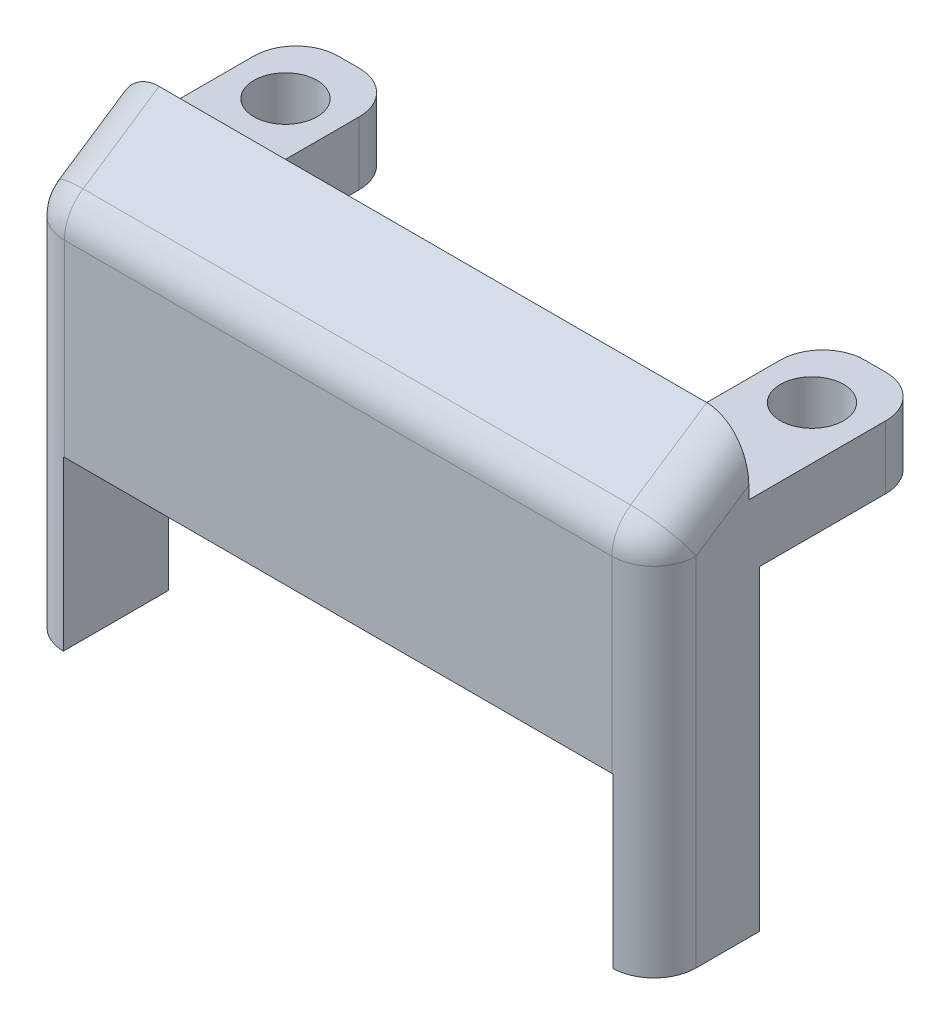
ISO-10303-21;
HEADER;
FILE_DESCRIPTION(('STEP AP214'),'2;1');
FILE_NAME('part.step','',(''),(''),'','','');
FILE_SCHEMA(('AUTOMOTIVE_DESIGN { 1 0 10303 214 1 1 1 1 }'));
ENDSEC;
DATA;
#1=APPLICATION_CONTEXT('core data for automotive mechanical design processes');
#2=APPLICATION_PROTOCOL_DEFINITION('international standard','automotive_design',2000,#1);
#3=PRODUCT_CONTEXT('',#1,'mechanical');
#4=PRODUCT('Part','Part','',(#3));
#5=PRODUCT_RELATED_PRODUCT_CATEGORY('part','',(#4));
#6=PRODUCT_DEFINITION_FORMATION('','',#4);
#7=PRODUCT_DEFINITION_CONTEXT('part definition',#1,'design');
#8=PRODUCT_DEFINITION('design','',#6,#7);
#9=PRODUCT_DEFINITION_SHAPE('','',#8);
#10=(LENGTH_UNIT() NAMED_UNIT(*) SI_UNIT(.MILLI.,.METRE.));
#11=(NAMED_UNIT(*) PLANE_ANGLE_UNIT() SI_UNIT($,.RADIAN.));
#12=(NAMED_UNIT(*) SI_UNIT($,.STERADIAN.) SOLID_ANGLE_UNIT());
#13=UNCERTAINTY_MEASURE_WITH_UNIT(LENGTH_MEASURE(1.E-05),#10,'distance_accuracy_value','');
#14=(GEOMETRIC_REPRESENTATION_CONTEXT(3) GLOBAL_UNCERTAINTY_ASSIGNED_CONTEXT((#13)) GLOBAL_UNIT_ASSIGNED_CONTEXT((#10,
#11,#12)) REPRESENTATION_CONTEXT('',''));
#15=CARTESIAN_POINT('',(0.,0.,0.));
#16=DIRECTION('',(0.,0.,1.));
#17=DIRECTION('',(1.,0.,0.));
#18=AXIS2_PLACEMENT_3D('',#15,#16,#17);
#19=CARTESIAN_POINT('',(13.05,10.,0.));
#20=DIRECTION('',(0.,1.,0.));
#21=DIRECTION('',(0.,0.,1.));
#22=AXIS2_PLACEMENT_3D('',#19,#20,#21);
#23=PLANE('',#22);
#24=CARTESIAN_POINT('',(-12.5,10.,-10.));
#25=DIRECTION('',(0.,1.,0.));
#26=DIRECTION('',(0.,0.,1.));
#27=AXIS2_PLACEMENT_3D('',#24,#25,#26);
#28=CIRCLE('',#27,1.5);
#29=CARTESIAN_POINT('',(-12.5,10.,-8.5));
#30=VERTEX_POINT('',#29);
#31=EDGE_CURVE('E292',#30,#30,#28,.T.);
#32=ORIENTED_EDGE('',*,*,#31,.F.);
#33=EDGE_LOOP('',(#32));
#34=FACE_BOUND('',#33,.T.);
#35=CARTESIAN_POINT('',(12.5,10.,-10.));
#36=DIRECTION('',(0.,1.,0.));
#37=DIRECTION('',(0.,0.,-1.));
#38=AXIS2_PLACEMENT_3D('',#35,#36,#37);
#39=CIRCLE('',#38,1.5);
#40=CARTESIAN_POINT('',(12.5,10.,-11.5));
#41=VERTEX_POINT('',#40);
#42=EDGE_CURVE('E288',#41,#41,#39,.T.);
#43=ORIENTED_EDGE('',*,*,#42,.F.);
#44=EDGE_LOOP('',(#43));
#45=FACE_BOUND('',#44,.T.);
#46=DIRECTION('',(-1.,0.,0.));
#47=VECTOR('',#46,1.);
#48=CARTESIAN_POINT('',(-15.,10.,-13.));
#49=LINE('',#48,#47);
#50=CARTESIAN_POINT('',(-12.,10.,-13.));
#51=VERTEX_POINT('',#50);
#52=CARTESIAN_POINT('',(-13.,10.,-13.));
#53=VERTEX_POINT('',#52);
#54=EDGE_CURVE('E308',#51,#53,#49,.T.);
#55=ORIENTED_EDGE('',*,*,#54,.T.);
#56=CARTESIAN_POINT('',(-13.,10.,-11.));
#57=DIRECTION('',(0.,1.,0.));
#58=DIRECTION('',(0.,0.,1.));
#59=AXIS2_PLACEMENT_3D('',#56,#57,#58);
#60=CIRCLE('',#59,2.);
#61=CARTESIAN_POINT('',(-15.,10.,-11.));
#62=VERTEX_POINT('',#61);
#63=EDGE_CURVE('E236',#53,#62,#60,.T.);
#64=ORIENTED_EDGE('',*,*,#63,.T.);
#65=DIRECTION('',(0.,0.,1.));
#66=VECTOR('',#65,1.);
#67=CARTESIAN_POINT('',(-15.,10.,0.));
#68=LINE('',#67,#66);
#69=CARTESIAN_POINT('',(-15.,10.,-4.5));
#70=VERTEX_POINT('',#69);
#71=EDGE_CURVE('E230',#62,#70,#68,.T.);
#72=ORIENTED_EDGE('',*,*,#71,.T.);
#73=DIRECTION('',(1.,0.,0.));
#74=VECTOR('',#73,1.);
#75=CARTESIAN_POINT('',(-20.408326913196,10.,-4.5));
#76=LINE('',#75,#74);
#77=CARTESIAN_POINT('',(15.,10.,-4.5));
#78=VERTEX_POINT('',#77);
#79=EDGE_CURVE('E235',#70,#78,#76,.T.);
#80=ORIENTED_EDGE('',*,*,#79,.T.);
#81=DIRECTION('',(0.,0.,1.));
#82=VECTOR('',#81,1.);
#83=CARTESIAN_POINT('',(15.,10.,0.));
#84=LINE('',#83,#82);
#85=CARTESIAN_POINT('',(15.,10.,-11.));
#86=VERTEX_POINT('',#85);
#87=EDGE_CURVE('E319',#86,#78,#84,.T.);
#88=ORIENTED_EDGE('',*,*,#87,.F.);
#89=CARTESIAN_POINT('',(13.,10.,-11.));
#90=DIRECTION('',(0.,1.,0.));
#91=DIRECTION('',(0.,0.,1.));
#92=AXIS2_PLACEMENT_3D('',#89,#90,#91);
#93=CIRCLE('',#92,2.);
#94=CARTESIAN_POINT('',(13.,10.,-13.));
#95=VERTEX_POINT('',#94);
#96=EDGE_CURVE('E435',#86,#95,#93,.T.);
#97=ORIENTED_EDGE('',*,*,#96,.T.);
#98=DIRECTION('',(-1.,0.,0.));
#99=VECTOR('',#98,1.);
#100=CARTESIAN_POINT('',(15.,10.,-13.));
#101=LINE('',#100,#99);
#102=CARTESIAN_POINT('',(12.,10.,-13.));
#103=VERTEX_POINT('',#102);
#104=EDGE_CURVE('E272',#95,#103,#101,.T.);
#105=ORIENTED_EDGE('',*,*,#104,.T.);
#106=CARTESIAN_POINT('',(12.,10.,-11.));
#107=DIRECTION('',(0.,1.,0.));
#108=DIRECTION('',(0.,0.,1.));
#109=AXIS2_PLACEMENT_3D('',#106,#107,#108);
#110=CIRCLE('',#109,2.);
#111=CARTESIAN_POINT('',(10.,10.,-11.));
#112=VERTEX_POINT('',#111);
#113=EDGE_CURVE('E438',#103,#112,#110,.T.);
#114=ORIENTED_EDGE('',*,*,#113,.T.);
#115=DIRECTION('',(0.,0.,1.));
#116=VECTOR('',#115,1.);
#117=CARTESIAN_POINT('',(10.,10.,-5.));
#118=LINE('',#117,#116);
#119=CARTESIAN_POINT('',(10.,10.,-7.));
#120=VERTEX_POINT('',#119);
#121=EDGE_CURVE('E268',#112,#120,#118,.T.);
#122=ORIENTED_EDGE('',*,*,#121,.T.);
#123=CARTESIAN_POINT('',(8.,10.,-7.));
#124=DIRECTION('',(0.,1.,0.));
#125=DIRECTION('',(0.,0.,1.));
#126=AXIS2_PLACEMENT_3D('',#123,#124,#125);
#127=CIRCLE('',#126,2.);
#128=CARTESIAN_POINT('',(8.,10.,-5.));
#129=VERTEX_POINT('',#128);
#130=EDGE_CURVE('E494',#120,#129,#127,.F.);
#131=ORIENTED_EDGE('',*,*,#130,.T.);
#132=DIRECTION('',(-1.,0.,0.));
#133=VECTOR('',#132,1.);
#134=CARTESIAN_POINT('',(13.05,10.,-5.));
#135=LINE('',#134,#133);
#136=CARTESIAN_POINT('',(-8.,10.,-5.));
#137=VERTEX_POINT('',#136);
#138=EDGE_CURVE('E384',#129,#137,#135,.T.);
#139=ORIENTED_EDGE('',*,*,#138,.T.);
#140=CARTESIAN_POINT('',(-8.,10.,-7.));
#141=DIRECTION('',(0.,1.,0.));
#142=DIRECTION('',(0.,0.,1.));
#143=AXIS2_PLACEMENT_3D('',#140,#141,#142);
#144=CIRCLE('',#143,2.);
#145=CARTESIAN_POINT('',(-10.,10.,-7.));
#146=VERTEX_POINT('',#145);
#147=EDGE_CURVE('E487',#137,#146,#144,.F.);
#148=ORIENTED_EDGE('',*,*,#147,.T.);
#149=DIRECTION('',(0.,0.,-1.));
#150=VECTOR('',#149,1.);
#151=CARTESIAN_POINT('',(-10.,10.,-5.));
#152=LINE('',#151,#150);
#153=CARTESIAN_POINT('',(-10.,10.,-11.));
#154=VERTEX_POINT('',#153);
#155=EDGE_CURVE('E300',#146,#154,#152,.T.);
#156=ORIENTED_EDGE('',*,*,#155,.T.);
#157=CARTESIAN_POINT('',(-12.,10.,-11.));
#158=DIRECTION('',(0.,1.,0.));
#159=DIRECTION('',(0.,0.,1.));
#160=AXIS2_PLACEMENT_3D('',#157,#158,#159);
#161=CIRCLE('',#160,2.);
#162=EDGE_CURVE('E441',#154,#51,#161,.T.);
#163=ORIENTED_EDGE('',*,*,#162,.T.);
#164=EDGE_LOOP('',(#55,#64,#72,#80,#88,#97,#105,#114,#122,#131,#139,#148,#156,#163));
#165=FACE_BOUND('',#164,.T.);
#166=ADVANCED_FACE('F49',(#34,#45,#165),#23,.T.);
#167=CARTESIAN_POINT('',(13.05,4.,0.));
#168=DIRECTION('',(0.,1.,0.));
#169=DIRECTION('',(0.,0.,1.));
#170=AXIS2_PLACEMENT_3D('',#167,#168,#169);
#171=PLANE('',#170);
#172=DIRECTION('',(0.,0.,-1.));
#173=VECTOR('',#172,1.);
#174=CARTESIAN_POINT('',(-13.05,4.,0.));
#175=LINE('',#174,#173);
#176=CARTESIAN_POINT('',(-13.05,4.,-3.));
#177=VERTEX_POINT('',#176);
#178=CARTESIAN_POINT('',(-13.05,4.,-5.));
#179=VERTEX_POINT('',#178);
#180=EDGE_CURVE('E359',#177,#179,#175,.T.);
#181=ORIENTED_EDGE('',*,*,#180,.T.);
#182=DIRECTION('',(-1.,0.,0.));
#183=VECTOR('',#182,1.);
#184=CARTESIAN_POINT('',(13.05,4.,-5.));
#185=LINE('',#184,#183);
#186=CARTESIAN_POINT('',(13.05,4.,-5.));
#187=VERTEX_POINT('',#186);
#188=EDGE_CURVE('E388',#187,#179,#185,.T.);
#189=ORIENTED_EDGE('',*,*,#188,.F.);
#190=DIRECTION('',(0.,0.,-1.));
#191=VECTOR('',#190,1.);
#192=CARTESIAN_POINT('',(13.05,4.,0.));
#193=LINE('',#192,#191);
#194=CARTESIAN_POINT('',(13.05,4.,-3.));
#195=VERTEX_POINT('',#194);
#196=EDGE_CURVE('E363',#195,#187,#193,.T.);
#197=ORIENTED_EDGE('',*,*,#196,.F.);
#198=DIRECTION('',(-1.,0.,0.));
#199=VECTOR('',#198,1.);
#200=CARTESIAN_POINT('',(13.05,4.,-3.));
#201=LINE('',#200,#199);
#202=EDGE_CURVE('E371',#195,#177,#201,.T.);
#203=ORIENTED_EDGE('',*,*,#202,.T.);
#204=EDGE_LOOP('',(#181,#189,#197,#203));
#205=FACE_BOUND('',#204,.T.);
#206=ADVANCED_FACE('F579',(#205),#171,.F.);
#207=CARTESIAN_POINT('',(13.05,0.,-5.));
#208=DIRECTION('',(0.,0.,1.));
#209=DIRECTION('',(1.,0.,0.));
#210=AXIS2_PLACEMENT_3D('',#207,#208,#209);
#211=PLANE('',#210);
#212=DIRECTION('',(1.,0.,0.));
#213=VECTOR('',#212,1.);
#214=CARTESIAN_POINT('',(-15.,7.,-5.));
#215=LINE('',#214,#213);
#216=CARTESIAN_POINT('',(-15.,7.,-5.));
#217=VERTEX_POINT('',#216);
#218=CARTESIAN_POINT('',(-8.,7.,-5.));
#219=VERTEX_POINT('',#218);
#220=EDGE_CURVE('E307',#217,#219,#215,.T.);
#221=ORIENTED_EDGE('',*,*,#220,.T.);
#222=DIRECTION('',(0.,1.,0.));
#223=VECTOR('',#222,1.);
#224=CARTESIAN_POINT('',(-8.,0.,-5.));
#225=LINE('',#224,#223);
#226=EDGE_CURVE('E463',#219,#137,#225,.T.);
#227=ORIENTED_EDGE('',*,*,#226,.T.);
#228=ORIENTED_EDGE('',*,*,#138,.F.);
#229=DIRECTION('',(0.,1.,0.));
#230=VECTOR('',#229,1.);
#231=CARTESIAN_POINT('',(8.,0.,-5.));
#232=LINE('',#231,#230);
#233=CARTESIAN_POINT('',(8.,7.,-5.));
#234=VERTEX_POINT('',#233);
#235=EDGE_CURVE('E459',#129,#234,#232,.F.);
#236=ORIENTED_EDGE('',*,*,#235,.T.);
#237=DIRECTION('',(1.,0.,0.));
#238=VECTOR('',#237,1.);
#239=CARTESIAN_POINT('',(15.,7.,-5.));
#240=LINE('',#239,#238);
#241=CARTESIAN_POINT('',(15.,7.,-5.));
#242=VERTEX_POINT('',#241);
#243=EDGE_CURVE('E259',#234,#242,#240,.T.);
#244=ORIENTED_EDGE('',*,*,#243,.T.);
#245=DIRECTION('',(0.,1.,0.));
#246=VECTOR('',#245,1.);
#247=CARTESIAN_POINT('',(15.,-8.,-5.));
#248=LINE('',#247,#246);
#249=CARTESIAN_POINT('',(15.,-8.,-5.));
#250=VERTEX_POINT('',#249);
#251=EDGE_CURVE('E335',#250,#242,#248,.T.);
#252=ORIENTED_EDGE('',*,*,#251,.F.);
#253=DIRECTION('',(1.,0.,0.));
#254=VECTOR('',#253,1.);
#255=CARTESIAN_POINT('',(0.,-8.,-5.));
#256=LINE('',#255,#254);
#257=CARTESIAN_POINT('',(13.05,-8.,-5.));
#258=VERTEX_POINT('',#257);
#259=EDGE_CURVE('E329',#258,#250,#256,.T.);
#260=ORIENTED_EDGE('',*,*,#259,.F.);
#261=DIRECTION('',(0.,1.,0.));
#262=VECTOR('',#261,1.);
#263=CARTESIAN_POINT('',(13.05,-8.,-5.));
#264=LINE('',#263,#262);
#265=EDGE_CURVE('E241',#258,#187,#264,.T.);
#266=ORIENTED_EDGE('',*,*,#265,.T.);
#267=ORIENTED_EDGE('',*,*,#188,.T.);
#268=DIRECTION('',(0.,1.,0.));
#269=VECTOR('',#268,1.);
#270=CARTESIAN_POINT('',(-13.05,-8.,-5.));
#271=LINE('',#270,#269);
#272=CARTESIAN_POINT('',(-13.05,-8.,-5.));
#273=VERTEX_POINT('',#272);
#274=EDGE_CURVE('E353',#273,#179,#271,.T.);
#275=ORIENTED_EDGE('',*,*,#274,.F.);
#276=DIRECTION('',(1.,0.,0.));
#277=VECTOR('',#276,1.);
#278=CARTESIAN_POINT('',(0.,-8.,-5.));
#279=LINE('',#278,#277);
#280=CARTESIAN_POINT('',(-15.,-8.,-5.));
#281=VERTEX_POINT('',#280);
#282=EDGE_CURVE('E351',#281,#273,#279,.T.);
#283=ORIENTED_EDGE('',*,*,#282,.F.);
#284=DIRECTION('',(0.,1.,0.));
#285=VECTOR('',#284,1.);
#286=CARTESIAN_POINT('',(-15.,-8.,-5.));
#287=LINE('',#286,#285);
#288=EDGE_CURVE('E355',#281,#217,#287,.T.);
#289=ORIENTED_EDGE('',*,*,#288,.T.);
#290=EDGE_LOOP('',(#221,#227,#228,#236,#244,#252,#260,#266,#267,#275,#283,#289));
#291=FACE_BOUND('',#290,.T.);
#292=ADVANCED_FACE('F587',(#291),#211,.F.);
#293=CARTESIAN_POINT('',(13.05,0.,0.));
#294=DIRECTION('',(0.,0.,1.));
#295=DIRECTION('',(1.,0.,0.));
#296=AXIS2_PLACEMENT_3D('',#293,#294,#295);
#297=PLANE('',#296);
#298=DIRECTION('',(0.,1.,0.));
#299=VECTOR('',#298,1.);
#300=CARTESIAN_POINT('',(13.,10.,0.));
#301=LINE('',#300,#299);
#302=CARTESIAN_POINT('',(13.,0.,0.));
#303=VERTEX_POINT('',#302);
#304=CARTESIAN_POINT('',(13.,8.92963248302401,0.));
#305=VERTEX_POINT('',#304);
#306=EDGE_CURVE('E394',#303,#305,#301,.T.);
#307=ORIENTED_EDGE('',*,*,#306,.T.);
#308=DIRECTION('',(-1.,0.,0.));
#309=VECTOR('',#308,1.);
#310=CARTESIAN_POINT('',(13.05,8.92963248302401,0.));
#311=LINE('',#310,#309);
#312=CARTESIAN_POINT('',(-13.,8.92963248302401,0.));
#313=VERTEX_POINT('',#312);
#314=EDGE_CURVE('E11',#305,#313,#311,.T.);
#315=ORIENTED_EDGE('',*,*,#314,.T.);
#316=DIRECTION('',(0.,1.,0.));
#317=VECTOR('',#316,1.);
#318=CARTESIAN_POINT('',(-13.,0.,0.));
#319=LINE('',#318,#317);
#320=CARTESIAN_POINT('',(-13.,0.,0.));
#321=VERTEX_POINT('',#320);
#322=EDGE_CURVE('E391',#313,#321,#319,.F.);
#323=ORIENTED_EDGE('',*,*,#322,.T.);
#324=DIRECTION('',(-1.,0.,0.));
#325=VECTOR('',#324,1.);
#326=CARTESIAN_POINT('',(13.05,0.,0.));
#327=LINE('',#326,#325);
#328=EDGE_CURVE('E380',#303,#321,#327,.T.);
#329=ORIENTED_EDGE('',*,*,#328,.F.);
#330=EDGE_LOOP('',(#307,#315,#323,#329));
#331=FACE_BOUND('',#330,.T.);
#332=ADVANCED_FACE('F563',(#331),#297,.T.);
#333=CARTESIAN_POINT('',(13.05,0.,0.));
#334=DIRECTION('',(0.,-0.6,-0.8));
#335=DIRECTION('',(0.,0.8,-0.6));
#336=AXIS2_PLACEMENT_3D('',#333,#334,#335);
#337=PLANE('',#336);
#338=DIRECTION('',(0.,-0.8,0.6));
#339=VECTOR('',#338,1.);
#340=CARTESIAN_POINT('',(13.05,0.,0.));
#341=LINE('',#340,#339);
#342=CARTESIAN_POINT('',(13.05,0.000833463582372244,-0.000625097686779725));
#343=VERTEX_POINT('',#342);
#344=EDGE_CURVE('E366',#195,#343,#341,.T.);
#345=ORIENTED_EDGE('',*,*,#344,.T.);
#346=CARTESIAN_POINT('',(13.,2.66666666666667,-2.));
#347=DIRECTION('',(0.,-0.6,-0.8));
#348=DIRECTION('',(0.,-0.8,0.6));
#349=AXIS2_PLACEMENT_3D('',#346,#347,#348);
#350=ELLIPSE('',#349,3.33333333333333,2.);
#351=EDGE_CURVE('E413',#343,#303,#350,.T.);
#352=ORIENTED_EDGE('',*,*,#351,.T.);
#353=ORIENTED_EDGE('',*,*,#328,.T.);
#354=CARTESIAN_POINT('',(-13.,2.66666666666667,-2.));
#355=DIRECTION('',(0.,-0.6,-0.8));
#356=DIRECTION('',(0.,0.8,-0.6));
#357=AXIS2_PLACEMENT_3D('',#354,#355,#356);
#358=ELLIPSE('',#357,3.33333333333333,2.);
#359=CARTESIAN_POINT('',(-13.05,0.000833463582372244,-0.000625097686779725));
#360=VERTEX_POINT('',#359);
#361=EDGE_CURVE('E410',#321,#360,#358,.T.);
#362=ORIENTED_EDGE('',*,*,#361,.T.);
#363=DIRECTION('',(0.,-0.8,0.6));
#364=VECTOR('',#363,1.);
#365=CARTESIAN_POINT('',(-13.05,0.,0.));
#366=LINE('',#365,#364);
#367=EDGE_CURVE('E367',#177,#360,#366,.T.);
#368=ORIENTED_EDGE('',*,*,#367,.F.);
#369=ORIENTED_EDGE('',*,*,#202,.F.);
#370=EDGE_LOOP('',(#345,#352,#353,#362,#368,#369));
#371=FACE_BOUND('',#370,.T.);
#372=ADVANCED_FACE('F844',(#371),#337,.T.);
#373=CARTESIAN_POINT('',(-15.,-8.,0.));
#374=DIRECTION('',(-1.,0.,0.));
#375=DIRECTION('',(0.,0.,1.));
#376=AXIS2_PLACEMENT_3D('',#373,#374,#375);
#377=PLANE('',#376);
#378=DIRECTION('',(0.,1.,0.));
#379=VECTOR('',#378,1.);
#380=CARTESIAN_POINT('',(-15.,-8.,-2.));
#381=LINE('',#380,#379);
#382=CARTESIAN_POINT('',(-15.,-8.,-2.));
#383=VERTEX_POINT('',#382);
#384=CARTESIAN_POINT('',(-15.,8.929632483024,-2.));
#385=VERTEX_POINT('',#384);
#386=EDGE_CURVE('E419',#383,#385,#381,.T.);
#387=ORIENTED_EDGE('',*,*,#386,.T.);
#388=DIRECTION('',(0.,-0.554700196225229,0.832050294337844));
#389=VECTOR('',#388,1.);
#390=CARTESIAN_POINT('',(-15.,2.79743787286277,7.19829191524185));
#391=LINE('',#390,#389);
#392=CARTESIAN_POINT('',(-15.,10.5962991496907,-4.5));
#393=VERTEX_POINT('',#392);
#394=EDGE_CURVE('E247',#385,#393,#391,.F.);
#395=ORIENTED_EDGE('',*,*,#394,.T.);
#396=DIRECTION('',(0.,1.,0.));
#397=VECTOR('',#396,1.);
#398=CARTESIAN_POINT('',(-15.,13.,-4.5));
#399=LINE('',#398,#397);
#400=EDGE_CURVE('E244',#70,#393,#399,.T.);
#401=ORIENTED_EDGE('',*,*,#400,.F.);
#402=ORIENTED_EDGE('',*,*,#71,.F.);
#403=DIRECTION('',(0.,1.,0.));
#404=VECTOR('',#403,1.);
#405=CARTESIAN_POINT('',(-15.,-8.,-11.));
#406=LINE('',#405,#404);
#407=CARTESIAN_POINT('',(-15.,7.,-11.));
#408=VERTEX_POINT('',#407);
#409=EDGE_CURVE('E416',#62,#408,#406,.F.);
#410=ORIENTED_EDGE('',*,*,#409,.T.);
#411=DIRECTION('',(0.,0.,1.));
#412=VECTOR('',#411,1.);
#413=CARTESIAN_POINT('',(-15.,7.,-5.));
#414=LINE('',#413,#412);
#415=EDGE_CURVE('E304',#408,#217,#414,.T.);
#416=ORIENTED_EDGE('',*,*,#415,.T.);
#417=ORIENTED_EDGE('',*,*,#288,.F.);
#418=DIRECTION('',(0.,0.,1.));
#419=VECTOR('',#418,1.);
#420=CARTESIAN_POINT('',(-15.,-8.,0.));
#421=LINE('',#420,#419);
#422=EDGE_CURVE('E240',#281,#383,#421,.T.);
#423=ORIENTED_EDGE('',*,*,#422,.T.);
#424=EDGE_LOOP('',(#387,#395,#401,#402,#410,#416,#417,#423));
#425=FACE_BOUND('',#424,.T.);
#426=ADVANCED_FACE('F245',(#425),#377,.T.);
#427=CARTESIAN_POINT('',(-13.05,-8.,0.));
#428=DIRECTION('',(-1.,0.,0.));
#429=DIRECTION('',(0.,0.,1.));
#430=AXIS2_PLACEMENT_3D('',#427,#428,#429);
#431=PLANE('',#430);
#432=ORIENTED_EDGE('',*,*,#367,.T.);
#433=DIRECTION('',(0.,1.,0.));
#434=VECTOR('',#433,1.);
#435=CARTESIAN_POINT('',(-13.05,0.00083346358237214,-0.000625097686779864));
#436=LINE('',#435,#434);
#437=CARTESIAN_POINT('',(-13.05,-8.,-0.000625097686779864));
#438=VERTEX_POINT('',#437);
#439=EDGE_CURVE('E422',#360,#438,#436,.F.);
#440=ORIENTED_EDGE('',*,*,#439,.T.);
#441=DIRECTION('',(0.,0.,1.));
#442=VECTOR('',#441,1.);
#443=CARTESIAN_POINT('',(-13.05,-8.,0.));
#444=LINE('',#443,#442);
#445=EDGE_CURVE('E347',#273,#438,#444,.T.);
#446=ORIENTED_EDGE('',*,*,#445,.F.);
#447=ORIENTED_EDGE('',*,*,#274,.T.);
#448=ORIENTED_EDGE('',*,*,#180,.F.);
#449=EDGE_LOOP('',(#432,#440,#446,#447,#448));
#450=FACE_BOUND('',#449,.T.);
#451=ADVANCED_FACE('F826',(#450),#431,.F.);
#452=CARTESIAN_POINT('',(0.,-8.,0.));
#453=DIRECTION('',(0.,1.,0.));
#454=DIRECTION('',(0.,0.,1.));
#455=AXIS2_PLACEMENT_3D('',#452,#453,#454);
#456=PLANE('',#455);
#457=ORIENTED_EDGE('',*,*,#445,.T.);
#458=CARTESIAN_POINT('',(-13.,-8.,-2.));
#459=DIRECTION('',(0.,1.,0.));
#460=DIRECTION('',(0.,0.,1.));
#461=AXIS2_PLACEMENT_3D('',#458,#459,#460);
#462=CIRCLE('',#461,2.);
#463=EDGE_CURVE('E425',#438,#383,#462,.F.);
#464=ORIENTED_EDGE('',*,*,#463,.T.);
#465=ORIENTED_EDGE('',*,*,#422,.F.);
#466=ORIENTED_EDGE('',*,*,#282,.T.);
#467=EDGE_LOOP('',(#457,#464,#465,#466));
#468=FACE_BOUND('',#467,.T.);
#469=ADVANCED_FACE('F817',(#468),#456,.F.);
#470=CARTESIAN_POINT('',(13.05,-8.,0.));
#471=DIRECTION('',(1.,0.,0.));
#472=DIRECTION('',(0.,0.,-1.));
#473=AXIS2_PLACEMENT_3D('',#470,#471,#472);
#474=PLANE('',#473);
#475=DIRECTION('',(0.,0.,-1.));
#476=VECTOR('',#475,1.);
#477=CARTESIAN_POINT('',(13.05,-8.,0.));
#478=LINE('',#477,#476);
#479=CARTESIAN_POINT('',(13.05,-8.,-0.000625097686779864));
#480=VERTEX_POINT('',#479);
#481=EDGE_CURVE('E332',#480,#258,#478,.T.);
#482=ORIENTED_EDGE('',*,*,#481,.F.);
#483=DIRECTION('',(0.,-1.,0.));
#484=VECTOR('',#483,1.);
#485=CARTESIAN_POINT('',(13.05,-8.,-0.000625097686779864));
#486=LINE('',#485,#484);
#487=EDGE_CURVE('E407',#480,#343,#486,.F.);
#488=ORIENTED_EDGE('',*,*,#487,.T.);
#489=ORIENTED_EDGE('',*,*,#344,.F.);
#490=ORIENTED_EDGE('',*,*,#196,.T.);
#491=ORIENTED_EDGE('',*,*,#265,.F.);
#492=EDGE_LOOP('',(#482,#488,#489,#490,#491));
#493=FACE_BOUND('',#492,.T.);
#494=ADVANCED_FACE('F808',(#493),#474,.F.);
#495=CARTESIAN_POINT('',(15.,-8.,0.));
#496=DIRECTION('',(-1.,0.,0.));
#497=DIRECTION('',(0.,0.,1.));
#498=AXIS2_PLACEMENT_3D('',#495,#496,#497);
#499=PLANE('',#498);
#500=DIRECTION('',(0.,1.,0.));
#501=VECTOR('',#500,1.);
#502=CARTESIAN_POINT('',(15.,13.,-4.5));
#503=LINE('',#502,#501);
#504=CARTESIAN_POINT('',(15.,10.5962991496907,-4.5));
#505=VERTEX_POINT('',#504);
#506=EDGE_CURVE('E252',#78,#505,#503,.T.);
#507=ORIENTED_EDGE('',*,*,#506,.T.);
#508=DIRECTION('',(0.,-0.554700196225229,0.832050294337844));
#509=VECTOR('',#508,1.);
#510=CARTESIAN_POINT('',(15.,9.66923274465765,-3.10940039245046));
#511=LINE('',#510,#509);
#512=CARTESIAN_POINT('',(15.,8.929632483024,-2.));
#513=VERTEX_POINT('',#512);
#514=EDGE_CURVE('E500',#505,#513,#511,.T.);
#515=ORIENTED_EDGE('',*,*,#514,.T.);
#516=DIRECTION('',(0.,1.,0.));
#517=VECTOR('',#516,1.);
#518=CARTESIAN_POINT('',(15.,-8.,-2.));
#519=LINE('',#518,#517);
#520=CARTESIAN_POINT('',(15.,-8.,-2.));
#521=VERTEX_POINT('',#520);
#522=EDGE_CURVE('E401',#513,#521,#519,.F.);
#523=ORIENTED_EDGE('',*,*,#522,.T.);
#524=DIRECTION('',(0.,0.,1.));
#525=VECTOR('',#524,1.);
#526=CARTESIAN_POINT('',(15.,-8.,0.));
#527=LINE('',#526,#525);
#528=EDGE_CURVE('E325',#250,#521,#527,.T.);
#529=ORIENTED_EDGE('',*,*,#528,.F.);
#530=ORIENTED_EDGE('',*,*,#251,.T.);
#531=DIRECTION('',(0.,0.,-1.));
#532=VECTOR('',#531,1.);
#533=CARTESIAN_POINT('',(15.,7.,-5.));
#534=LINE('',#533,#532);
#535=CARTESIAN_POINT('',(15.,7.,-11.));
#536=VERTEX_POINT('',#535);
#537=EDGE_CURVE('E273',#242,#536,#534,.T.);
#538=ORIENTED_EDGE('',*,*,#537,.T.);
#539=DIRECTION('',(0.,1.,0.));
#540=VECTOR('',#539,1.);
#541=CARTESIAN_POINT('',(15.,10.,-11.));
#542=LINE('',#541,#540);
#543=EDGE_CURVE('E397',#536,#86,#542,.T.);
#544=ORIENTED_EDGE('',*,*,#543,.T.);
#545=ORIENTED_EDGE('',*,*,#87,.T.);
#546=EDGE_LOOP('',(#507,#515,#523,#529,#530,#538,#544,#545));
#547=FACE_BOUND('',#546,.T.);
#548=ADVANCED_FACE('F546',(#547),#499,.F.);
#549=CARTESIAN_POINT('',(0.,-8.,0.));
#550=DIRECTION('',(0.,1.,0.));
#551=DIRECTION('',(0.,0.,1.));
#552=AXIS2_PLACEMENT_3D('',#549,#550,#551);
#553=PLANE('',#552);
#554=ORIENTED_EDGE('',*,*,#528,.T.);
#555=CARTESIAN_POINT('',(13.,-8.,-2.));
#556=DIRECTION('',(0.,1.,0.));
#557=DIRECTION('',(0.,0.,1.));
#558=AXIS2_PLACEMENT_3D('',#555,#556,#557);
#559=CIRCLE('',#558,2.);
#560=EDGE_CURVE('E404',#521,#480,#559,.F.);
#561=ORIENTED_EDGE('',*,*,#560,.T.);
#562=ORIENTED_EDGE('',*,*,#481,.T.);
#563=ORIENTED_EDGE('',*,*,#259,.T.);
#564=EDGE_LOOP('',(#554,#561,#562,#563));
#565=FACE_BOUND('',#564,.T.);
#566=ADVANCED_FACE('F789',(#565),#553,.F.);
#567=CARTESIAN_POINT('',(-15.,7.,-13.));
#568=DIRECTION('',(0.,0.,-1.));
#569=DIRECTION('',(-1.,0.,0.));
#570=AXIS2_PLACEMENT_3D('',#567,#568,#569);
#571=PLANE('',#570);
#572=DIRECTION('',(-1.,0.,0.));
#573=VECTOR('',#572,1.);
#574=CARTESIAN_POINT('',(-15.,7.,-13.));
#575=LINE('',#574,#573);
#576=CARTESIAN_POINT('',(-12.,7.,-13.));
#577=VERTEX_POINT('',#576);
#578=CARTESIAN_POINT('',(-13.,7.,-13.));
#579=VERTEX_POINT('',#578);
#580=EDGE_CURVE('E315',#577,#579,#575,.T.);
#581=ORIENTED_EDGE('',*,*,#580,.T.);
#582=DIRECTION('',(0.,1.,0.));
#583=VECTOR('',#582,1.);
#584=CARTESIAN_POINT('',(-13.,7.,-13.));
#585=LINE('',#584,#583);
#586=EDGE_CURVE('E431',#579,#53,#585,.T.);
#587=ORIENTED_EDGE('',*,*,#586,.T.);
#588=ORIENTED_EDGE('',*,*,#54,.F.);
#589=DIRECTION('',(0.,1.,0.));
#590=VECTOR('',#589,1.);
#591=CARTESIAN_POINT('',(-12.,7.,-13.));
#592=LINE('',#591,#590);
#593=EDGE_CURVE('E428',#51,#577,#592,.F.);
#594=ORIENTED_EDGE('',*,*,#593,.T.);
#595=EDGE_LOOP('',(#581,#587,#588,#594));
#596=FACE_BOUND('',#595,.T.);
#597=ADVANCED_FACE('F780',(#596),#571,.T.);
#598=CARTESIAN_POINT('',(-10.,7.,-5.));
#599=DIRECTION('',(1.,0.,0.));
#600=DIRECTION('',(0.,0.,-1.));
#601=AXIS2_PLACEMENT_3D('',#598,#599,#600);
#602=PLANE('',#601);
#603=DIRECTION('',(0.,0.,-1.));
#604=VECTOR('',#603,1.);
#605=CARTESIAN_POINT('',(-10.,7.,-5.));
#606=LINE('',#605,#604);
#607=CARTESIAN_POINT('',(-10.,7.,-7.));
#608=VERTEX_POINT('',#607);
#609=CARTESIAN_POINT('',(-10.,7.,-11.));
#610=VERTEX_POINT('',#609);
#611=EDGE_CURVE('E311',#608,#610,#606,.T.);
#612=ORIENTED_EDGE('',*,*,#611,.T.);
#613=DIRECTION('',(0.,1.,0.));
#614=VECTOR('',#613,1.);
#615=CARTESIAN_POINT('',(-10.,7.,-11.));
#616=LINE('',#615,#614);
#617=EDGE_CURVE('E455',#610,#154,#616,.T.);
#618=ORIENTED_EDGE('',*,*,#617,.T.);
#619=ORIENTED_EDGE('',*,*,#155,.F.);
#620=DIRECTION('',(0.,1.,0.));
#621=VECTOR('',#620,1.);
#622=CARTESIAN_POINT('',(-10.,7.,-7.));
#623=LINE('',#622,#621);
#624=EDGE_CURVE('E452',#146,#608,#623,.F.);
#625=ORIENTED_EDGE('',*,*,#624,.T.);
#626=EDGE_LOOP('',(#612,#618,#619,#625));
#627=FACE_BOUND('',#626,.T.);
#628=ADVANCED_FACE('F771',(#627),#602,.T.);
#629=CARTESIAN_POINT('',(0.,7.,0.));
#630=DIRECTION('',(0.,-1.,0.));
#631=DIRECTION('',(0.,0.,-1.));
#632=AXIS2_PLACEMENT_3D('',#629,#630,#631);
#633=PLANE('',#632);
#634=CARTESIAN_POINT('',(-12.5,7.,-10.));
#635=DIRECTION('',(0.,1.,0.));
#636=DIRECTION('',(0.,0.,1.));
#637=AXIS2_PLACEMENT_3D('',#634,#635,#636);
#638=CIRCLE('',#637,1.5);
#639=CARTESIAN_POINT('',(-12.5,7.,-8.5));
#640=VERTEX_POINT('',#639);
#641=EDGE_CURVE('E296',#640,#640,#638,.T.);
#642=ORIENTED_EDGE('',*,*,#641,.T.);
#643=EDGE_LOOP('',(#642));
#644=FACE_BOUND('',#643,.T.);
#645=ORIENTED_EDGE('',*,*,#415,.F.);
#646=CARTESIAN_POINT('',(-13.,7.,-11.));
#647=DIRECTION('',(0.,-1.,0.));
#648=DIRECTION('',(0.,0.,-1.));
#649=AXIS2_PLACEMENT_3D('',#646,#647,#648);
#650=CIRCLE('',#649,2.);
#651=EDGE_CURVE('E449',#408,#579,#650,.T.);
#652=ORIENTED_EDGE('',*,*,#651,.T.);
#653=ORIENTED_EDGE('',*,*,#580,.F.);
#654=CARTESIAN_POINT('',(-12.,7.,-11.));
#655=DIRECTION('',(0.,-1.,0.));
#656=DIRECTION('',(0.,0.,-1.));
#657=AXIS2_PLACEMENT_3D('',#654,#655,#656);
#658=CIRCLE('',#657,2.);
#659=EDGE_CURVE('E446',#577,#610,#658,.T.);
#660=ORIENTED_EDGE('',*,*,#659,.T.);
#661=ORIENTED_EDGE('',*,*,#611,.F.);
#662=CARTESIAN_POINT('',(-8.,7.,-7.));
#663=DIRECTION('',(0.,-1.,0.));
#664=DIRECTION('',(0.,0.,-1.));
#665=AXIS2_PLACEMENT_3D('',#662,#663,#664);
#666=CIRCLE('',#665,2.);
#667=EDGE_CURVE('E490',#608,#219,#666,.F.);
#668=ORIENTED_EDGE('',*,*,#667,.T.);
#669=ORIENTED_EDGE('',*,*,#220,.F.);
#670=EDGE_LOOP('',(#645,#652,#653,#660,#661,#668,#669));
#671=FACE_BOUND('',#670,.T.);
#672=ADVANCED_FACE('F762',(#644,#671),#633,.T.);
#673=CARTESIAN_POINT('',(-12.5,7.,-10.));
#674=DIRECTION('',(0.,1.,0.));
#675=DIRECTION('',(0.,0.,1.));
#676=AXIS2_PLACEMENT_3D('',#673,#674,#675);
#677=CYLINDRICAL_SURFACE('',#676,1.5);
#678=ORIENTED_EDGE('',*,*,#641,.F.);
#679=EDGE_LOOP('',(#678));
#680=FACE_BOUND('',#679,.T.);
#681=ORIENTED_EDGE('',*,*,#31,.T.);
#682=EDGE_LOOP('',(#681));
#683=FACE_BOUND('',#682,.T.);
#684=ADVANCED_FACE('F753',(#680,#683),#677,.F.);
#685=CARTESIAN_POINT('',(10.,7.,-5.));
#686=DIRECTION('',(-1.,0.,0.));
#687=DIRECTION('',(0.,0.,1.));
#688=AXIS2_PLACEMENT_3D('',#685,#686,#687);
#689=PLANE('',#688);
#690=DIRECTION('',(0.,0.,1.));
#691=VECTOR('',#690,1.);
#692=CARTESIAN_POINT('',(10.,7.,-5.));
#693=LINE('',#692,#691);
#694=CARTESIAN_POINT('',(10.,7.,-11.));
#695=VERTEX_POINT('',#694);
#696=CARTESIAN_POINT('',(10.,7.,-7.));
#697=VERTEX_POINT('',#696);
#698=EDGE_CURVE('E264',#695,#697,#693,.T.);
#699=ORIENTED_EDGE('',*,*,#698,.T.);
#700=DIRECTION('',(0.,1.,0.));
#701=VECTOR('',#700,1.);
#702=CARTESIAN_POINT('',(10.,7.,-7.));
#703=LINE('',#702,#701);
#704=EDGE_CURVE('E470',#697,#120,#703,.T.);
#705=ORIENTED_EDGE('',*,*,#704,.T.);
#706=ORIENTED_EDGE('',*,*,#121,.F.);
#707=DIRECTION('',(0.,1.,0.));
#708=VECTOR('',#707,1.);
#709=CARTESIAN_POINT('',(10.,7.,-11.));
#710=LINE('',#709,#708);
#711=EDGE_CURVE('E467',#112,#695,#710,.F.);
#712=ORIENTED_EDGE('',*,*,#711,.T.);
#713=EDGE_LOOP('',(#699,#705,#706,#712));
#714=FACE_BOUND('',#713,.T.);
#715=ADVANCED_FACE('F744',(#714),#689,.T.);
#716=CARTESIAN_POINT('',(15.,7.,-13.));
#717=DIRECTION('',(0.,0.,-1.));
#718=DIRECTION('',(-1.,0.,0.));
#719=AXIS2_PLACEMENT_3D('',#716,#717,#718);
#720=PLANE('',#719);
#721=DIRECTION('',(-1.,0.,0.));
#722=VECTOR('',#721,1.);
#723=CARTESIAN_POINT('',(15.,7.,-13.));
#724=LINE('',#723,#722);
#725=CARTESIAN_POINT('',(13.,7.,-13.));
#726=VERTEX_POINT('',#725);
#727=CARTESIAN_POINT('',(12.,7.,-13.));
#728=VERTEX_POINT('',#727);
#729=EDGE_CURVE('E281',#726,#728,#724,.T.);
#730=ORIENTED_EDGE('',*,*,#729,.T.);
#731=DIRECTION('',(0.,1.,0.));
#732=VECTOR('',#731,1.);
#733=CARTESIAN_POINT('',(12.,7.,-13.));
#734=LINE('',#733,#732);
#735=EDGE_CURVE('E477',#728,#103,#734,.T.);
#736=ORIENTED_EDGE('',*,*,#735,.T.);
#737=ORIENTED_EDGE('',*,*,#104,.F.);
#738=DIRECTION('',(0.,1.,0.));
#739=VECTOR('',#738,1.);
#740=CARTESIAN_POINT('',(13.,7.,-13.));
#741=LINE('',#740,#739);
#742=EDGE_CURVE('E474',#95,#726,#741,.F.);
#743=ORIENTED_EDGE('',*,*,#742,.T.);
#744=EDGE_LOOP('',(#730,#736,#737,#743));
#745=FACE_BOUND('',#744,.T.);
#746=ADVANCED_FACE('F735',(#745),#720,.T.);
#747=CARTESIAN_POINT('',(0.,7.,0.));
#748=DIRECTION('',(0.,1.,0.));
#749=DIRECTION('',(0.,0.,1.));
#750=AXIS2_PLACEMENT_3D('',#747,#748,#749);
#751=PLANE('',#750);
#752=CARTESIAN_POINT('',(12.5,7.,-10.));
#753=DIRECTION('',(0.,1.,0.));
#754=DIRECTION('',(0.,0.,-1.));
#755=AXIS2_PLACEMENT_3D('',#752,#753,#754);
#756=CIRCLE('',#755,1.5);
#757=CARTESIAN_POINT('',(12.5,7.,-11.5));
#758=VERTEX_POINT('',#757);
#759=EDGE_CURVE('E276',#758,#758,#756,.T.);
#760=ORIENTED_EDGE('',*,*,#759,.T.);
#761=EDGE_LOOP('',(#760));
#762=FACE_BOUND('',#761,.T.);
#763=ORIENTED_EDGE('',*,*,#698,.F.);
#764=CARTESIAN_POINT('',(12.,7.,-11.));
#765=DIRECTION('',(0.,1.,0.));
#766=DIRECTION('',(0.,0.,1.));
#767=AXIS2_PLACEMENT_3D('',#764,#765,#766);
#768=CIRCLE('',#767,2.);
#769=EDGE_CURVE('E484',#695,#728,#768,.F.);
#770=ORIENTED_EDGE('',*,*,#769,.T.);
#771=ORIENTED_EDGE('',*,*,#729,.F.);
#772=CARTESIAN_POINT('',(13.,7.,-11.));
#773=DIRECTION('',(0.,1.,0.));
#774=DIRECTION('',(0.,0.,1.));
#775=AXIS2_PLACEMENT_3D('',#772,#773,#774);
#776=CIRCLE('',#775,2.);
#777=EDGE_CURVE('E481',#726,#536,#776,.F.);
#778=ORIENTED_EDGE('',*,*,#777,.T.);
#779=ORIENTED_EDGE('',*,*,#537,.F.);
#780=ORIENTED_EDGE('',*,*,#243,.F.);
#781=CARTESIAN_POINT('',(8.,7.,-7.));
#782=DIRECTION('',(0.,1.,0.));
#783=DIRECTION('',(0.,0.,1.));
#784=AXIS2_PLACEMENT_3D('',#781,#782,#783);
#785=CIRCLE('',#784,2.);
#786=EDGE_CURVE('E497',#234,#697,#785,.T.);
#787=ORIENTED_EDGE('',*,*,#786,.T.);
#788=EDGE_LOOP('',(#763,#770,#771,#778,#779,#780,#787));
#789=FACE_BOUND('',#788,.T.);
#790=ADVANCED_FACE('F725',(#762,#789),#751,.F.);
#791=CARTESIAN_POINT('',(12.5,7.,-10.));
#792=DIRECTION('',(0.,1.,0.));
#793=DIRECTION('',(0.,0.,1.));
#794=AXIS2_PLACEMENT_3D('',#791,#792,#793);
#795=CYLINDRICAL_SURFACE('',#794,1.5);
#796=ORIENTED_EDGE('',*,*,#759,.F.);
#797=EDGE_LOOP('',(#796));
#798=FACE_BOUND('',#797,.T.);
#799=ORIENTED_EDGE('',*,*,#42,.T.);
#800=EDGE_LOOP('',(#799));
#801=FACE_BOUND('',#800,.T.);
#802=ADVANCED_FACE('F710',(#798,#801),#795,.F.);
#803=CARTESIAN_POINT('',(-20.408326913196,13.,-4.5));
#804=DIRECTION('',(0.,0.,-1.));
#805=DIRECTION('',(0.,1.,0.));
#806=AXIS2_PLACEMENT_3D('',#803,#804,#805);
#807=PLANE('',#806);
#808=DIRECTION('',(1.,0.,0.));
#809=VECTOR('',#808,1.);
#810=CARTESIAN_POINT('',(-20.408326913196,13.,-4.5));
#811=LINE('',#810,#809);
#812=CARTESIAN_POINT('',(-13.,13.,-4.5));
#813=VERTEX_POINT('',#812);
#814=CARTESIAN_POINT('',(13.,13.,-4.5));
#815=VERTEX_POINT('',#814);
#816=EDGE_CURVE('E251',#813,#815,#811,.T.);
#817=ORIENTED_EDGE('',*,*,#816,.T.);
#818=CARTESIAN_POINT('',(13.,10.5962991496907,-4.5));
#819=DIRECTION('',(0.,0.,-1.));
#820=DIRECTION('',(0.,1.,0.));
#821=AXIS2_PLACEMENT_3D('',#818,#819,#820);
#822=ELLIPSE('',#821,2.40370085030933,2.);
#823=EDGE_CURVE('E516',#815,#505,#822,.T.);
#824=ORIENTED_EDGE('',*,*,#823,.T.);
#825=ORIENTED_EDGE('',*,*,#506,.F.);
#826=ORIENTED_EDGE('',*,*,#79,.F.);
#827=ORIENTED_EDGE('',*,*,#400,.T.);
#828=CARTESIAN_POINT('',(-13.,10.5962991496907,-4.5));
#829=DIRECTION('',(0.,0.,-1.));
#830=DIRECTION('',(0.,-1.,0.));
#831=AXIS2_PLACEMENT_3D('',#828,#829,#830);
#832=ELLIPSE('',#831,2.40370085030933,2.);
#833=EDGE_CURVE('E513',#393,#813,#832,.T.);
#834=ORIENTED_EDGE('',*,*,#833,.T.);
#835=EDGE_LOOP('',(#817,#824,#825,#826,#827,#834));
#836=FACE_BOUND('',#835,.T.);
#837=ADVANCED_FACE('F256',(#836),#807,.T.);
#838=CARTESIAN_POINT('',(-20.408326913196,10.,0.));
#839=DIRECTION('',(0.,0.832050294337844,0.554700196225229));
#840=DIRECTION('',(0.,-0.554700196225229,0.832050294337844));
#841=AXIS2_PLACEMENT_3D('',#838,#839,#840);
#842=PLANE('',#841);
#843=DIRECTION('',(-1.,0.,0.));
#844=VECTOR('',#843,1.);
#845=CARTESIAN_POINT('',(-20.408326913196,10.5937330716997,-0.890599607549541));
#846=LINE('',#845,#844);
#847=CARTESIAN_POINT('',(-13.,10.5937330716997,-0.890599607549541));
#848=VERTEX_POINT('',#847);
#849=CARTESIAN_POINT('',(13.,10.5937330716997,-0.890599607549541));
#850=VERTEX_POINT('',#849);
#851=EDGE_CURVE('E504',#848,#850,#846,.F.);
#852=ORIENTED_EDGE('',*,*,#851,.T.);
#853=DIRECTION('',(0.,-0.554700196225229,0.832050294337844));
#854=VECTOR('',#853,1.);
#855=CARTESIAN_POINT('',(13.,13.,-4.5));
#856=LINE('',#855,#854);
#857=EDGE_CURVE('E510',#850,#815,#856,.F.);
#858=ORIENTED_EDGE('',*,*,#857,.T.);
#859=ORIENTED_EDGE('',*,*,#816,.F.);
#860=DIRECTION('',(0.,-0.554700196225229,0.832050294337844));
#861=VECTOR('',#860,1.);
#862=CARTESIAN_POINT('',(-13.,10.,0.));
#863=LINE('',#862,#861);
#864=EDGE_CURVE('E507',#813,#848,#863,.T.);
#865=ORIENTED_EDGE('',*,*,#864,.T.);
#866=EDGE_LOOP('',(#852,#858,#859,#865));
#867=FACE_BOUND('',#866,.T.);
#868=ADVANCED_FACE('F566',(#867),#842,.T.);
#869=CARTESIAN_POINT('',(13.,0.,-2.));
#870=DIRECTION('',(0.,-1.,0.));
#871=DIRECTION('',(0.,0.,-1.));
#872=AXIS2_PLACEMENT_3D('',#869,#870,#871);
#873=CYLINDRICAL_SURFACE('',#872,2.);
#874=ORIENTED_EDGE('',*,*,#522,.F.);
#875=CARTESIAN_POINT('',(13.,8.92963248302401,-2.));
#876=DIRECTION('',(0.,-1.,0.));
#877=DIRECTION('',(0.,0.,-1.));
#878=AXIS2_PLACEMENT_3D('',#875,#876,#877);
#879=CIRCLE('',#878,2.);
#880=EDGE_CURVE('E519',#513,#305,#879,.T.);
#881=ORIENTED_EDGE('',*,*,#880,.T.);
#882=ORIENTED_EDGE('',*,*,#306,.F.);
#883=ORIENTED_EDGE('',*,*,#351,.F.);
#884=ORIENTED_EDGE('',*,*,#487,.F.);
#885=ORIENTED_EDGE('',*,*,#560,.F.);
#886=EDGE_LOOP('',(#874,#881,#882,#883,#884,#885));
#887=FACE_BOUND('',#886,.T.);
#888=ADVANCED_FACE('F559',(#887),#873,.T.);
#889=CARTESIAN_POINT('',(-13.,-8.,-2.));
#890=DIRECTION('',(0.,1.,0.));
#891=DIRECTION('',(0.,0.,1.));
#892=AXIS2_PLACEMENT_3D('',#889,#890,#891);
#893=CYLINDRICAL_SURFACE('',#892,2.);
#894=ORIENTED_EDGE('',*,*,#322,.F.);
#895=CARTESIAN_POINT('',(-13.,8.929632483024,-2.));
#896=DIRECTION('',(0.,1.,0.));
#897=DIRECTION('',(0.,0.,1.));
#898=AXIS2_PLACEMENT_3D('',#895,#896,#897);
#899=CIRCLE('',#898,2.);
#900=EDGE_CURVE('E59',#313,#385,#899,.F.);
#901=ORIENTED_EDGE('',*,*,#900,.T.);
#902=ORIENTED_EDGE('',*,*,#386,.F.);
#903=ORIENTED_EDGE('',*,*,#463,.F.);
#904=ORIENTED_EDGE('',*,*,#439,.F.);
#905=ORIENTED_EDGE('',*,*,#361,.F.);
#906=EDGE_LOOP('',(#894,#901,#902,#903,#904,#905));
#907=FACE_BOUND('',#906,.T.);
#908=ADVANCED_FACE('F599',(#907),#893,.T.);
#909=CARTESIAN_POINT('',(-13.,7.,-11.));
#910=DIRECTION('',(0.,1.,0.));
#911=DIRECTION('',(0.,0.,1.));
#912=AXIS2_PLACEMENT_3D('',#909,#910,#911);
#913=CYLINDRICAL_SURFACE('',#912,2.);
#914=ORIENTED_EDGE('',*,*,#651,.F.);
#915=ORIENTED_EDGE('',*,*,#409,.F.);
#916=ORIENTED_EDGE('',*,*,#63,.F.);
#917=ORIENTED_EDGE('',*,*,#586,.F.);
#918=EDGE_LOOP('',(#914,#915,#916,#917));
#919=FACE_BOUND('',#918,.T.);
#920=ADVANCED_FACE('F602',(#919),#913,.T.);
#921=CARTESIAN_POINT('',(-12.,7.,-11.));
#922=DIRECTION('',(0.,1.,0.));
#923=DIRECTION('',(0.,0.,1.));
#924=AXIS2_PLACEMENT_3D('',#921,#922,#923);
#925=CYLINDRICAL_SURFACE('',#924,2.);
#926=ORIENTED_EDGE('',*,*,#659,.F.);
#927=ORIENTED_EDGE('',*,*,#593,.F.);
#928=ORIENTED_EDGE('',*,*,#162,.F.);
#929=ORIENTED_EDGE('',*,*,#617,.F.);
#930=EDGE_LOOP('',(#926,#927,#928,#929));
#931=FACE_BOUND('',#930,.T.);
#932=ADVANCED_FACE('F605',(#931),#925,.T.);
#933=CARTESIAN_POINT('',(-8.,0.,-7.));
#934=DIRECTION('',(0.,1.,0.));
#935=DIRECTION('',(0.,0.,1.));
#936=AXIS2_PLACEMENT_3D('',#933,#934,#935);
#937=CYLINDRICAL_SURFACE('',#936,2.);
#938=ORIENTED_EDGE('',*,*,#667,.F.);
#939=ORIENTED_EDGE('',*,*,#624,.F.);
#940=ORIENTED_EDGE('',*,*,#147,.F.);
#941=ORIENTED_EDGE('',*,*,#226,.F.);
#942=EDGE_LOOP('',(#938,#939,#940,#941));
#943=FACE_BOUND('',#942,.T.);
#944=ADVANCED_FACE('F609',(#943),#937,.F.);
#945=CARTESIAN_POINT('',(8.,7.,-7.));
#946=DIRECTION('',(0.,1.,0.));
#947=DIRECTION('',(0.,0.,1.));
#948=AXIS2_PLACEMENT_3D('',#945,#946,#947);
#949=CYLINDRICAL_SURFACE('',#948,2.);
#950=ORIENTED_EDGE('',*,*,#786,.F.);
#951=ORIENTED_EDGE('',*,*,#235,.F.);
#952=ORIENTED_EDGE('',*,*,#130,.F.);
#953=ORIENTED_EDGE('',*,*,#704,.F.);
#954=EDGE_LOOP('',(#950,#951,#952,#953));
#955=FACE_BOUND('',#954,.T.);
#956=ADVANCED_FACE('F613',(#955),#949,.F.);
#957=CARTESIAN_POINT('',(12.,7.,-11.));
#958=DIRECTION('',(0.,1.,0.));
#959=DIRECTION('',(0.,0.,1.));
#960=AXIS2_PLACEMENT_3D('',#957,#958,#959);
#961=CYLINDRICAL_SURFACE('',#960,2.);
#962=ORIENTED_EDGE('',*,*,#769,.F.);
#963=ORIENTED_EDGE('',*,*,#711,.F.);
#964=ORIENTED_EDGE('',*,*,#113,.F.);
#965=ORIENTED_EDGE('',*,*,#735,.F.);
#966=EDGE_LOOP('',(#962,#963,#964,#965));
#967=FACE_BOUND('',#966,.T.);
#968=ADVANCED_FACE('F617',(#967),#961,.T.);
#969=CARTESIAN_POINT('',(13.,-8.,-11.));
#970=DIRECTION('',(0.,-1.,0.));
#971=DIRECTION('',(0.,0.,-1.));
#972=AXIS2_PLACEMENT_3D('',#969,#970,#971);
#973=CYLINDRICAL_SURFACE('',#972,2.);
#974=ORIENTED_EDGE('',*,*,#777,.F.);
#975=ORIENTED_EDGE('',*,*,#742,.F.);
#976=ORIENTED_EDGE('',*,*,#96,.F.);
#977=ORIENTED_EDGE('',*,*,#543,.F.);
#978=EDGE_LOOP('',(#974,#975,#976,#977));
#979=FACE_BOUND('',#978,.T.);
#980=ADVANCED_FACE('F577',(#979),#973,.T.);
#981=CARTESIAN_POINT('',(-13.,8.33589941132431,-1.10940039245046));
#982=DIRECTION('',(0.,-0.554700196225229,0.832050294337844));
#983=DIRECTION('',(0.,-0.832050294337844,-0.554700196225229));
#984=AXIS2_PLACEMENT_3D('',#981,#982,#983);
#985=CYLINDRICAL_SURFACE('',#984,2.);
#986=ORIENTED_EDGE('',*,*,#833,.F.);
#987=ORIENTED_EDGE('',*,*,#394,.F.);
#988=CARTESIAN_POINT('',(-13.,8.92963248302401,-2.));
#989=DIRECTION('',(0.,-0.554700196225229,0.832050294337844));
#990=DIRECTION('',(0.,-0.832050294337844,-0.554700196225229));
#991=AXIS2_PLACEMENT_3D('',#988,#989,#990);
#992=CIRCLE('',#991,2.);
#993=EDGE_CURVE('E53',#848,#385,#992,.T.);
#994=ORIENTED_EDGE('',*,*,#993,.F.);
#995=ORIENTED_EDGE('',*,*,#864,.F.);
#996=EDGE_LOOP('',(#986,#987,#994,#995));
#997=FACE_BOUND('',#996,.T.);
#998=ADVANCED_FACE('F51',(#997),#985,.T.);
#999=CARTESIAN_POINT('',(-13.,8.929632483024,-2.));
#1000=DIRECTION('',(0.,0.832050294337844,0.554700196225229));
#1001=DIRECTION('',(0.,-0.554700196225229,0.832050294337844));
#1002=AXIS2_PLACEMENT_3D('',#999,#1000,#1001);
#1003=SPHERICAL_SURFACE('',#1002,2.);
#1004=ORIENTED_EDGE('',*,*,#993,.T.);
#1005=ORIENTED_EDGE('',*,*,#900,.F.);
#1006=CARTESIAN_POINT('',(-13.,8.92963248302401,-2.));
#1007=DIRECTION('',(1.,0.,0.));
#1008=DIRECTION('',(0.,0.,-1.));
#1009=AXIS2_PLACEMENT_3D('',#1006,#1007,#1008);
#1010=CIRCLE('',#1009,2.);
#1011=EDGE_CURVE('E532',#848,#313,#1010,.T.);
#1012=ORIENTED_EDGE('',*,*,#1011,.F.);
#1013=EDGE_LOOP('',(#1004,#1005,#1012));
#1014=FACE_BOUND('',#1013,.T.);
#1015=ADVANCED_FACE('F570',(#1014),#1003,.T.);
#1016=CARTESIAN_POINT('',(13.05,8.92963248302401,-2.));
#1017=DIRECTION('',(-1.,0.,0.));
#1018=DIRECTION('',(0.,0.,1.));
#1019=AXIS2_PLACEMENT_3D('',#1016,#1017,#1018);
#1020=CYLINDRICAL_SURFACE('',#1019,2.);
#1021=ORIENTED_EDGE('',*,*,#1011,.T.);
#1022=ORIENTED_EDGE('',*,*,#314,.F.);
#1023=CARTESIAN_POINT('',(13.,8.92963248302401,-2.));
#1024=DIRECTION('',(1.,0.,0.));
#1025=DIRECTION('',(0.,0.,-1.));
#1026=AXIS2_PLACEMENT_3D('',#1023,#1024,#1025);
#1027=CIRCLE('',#1026,2.);
#1028=EDGE_CURVE('E529',#850,#305,#1027,.T.);
#1029=ORIENTED_EDGE('',*,*,#1028,.F.);
#1030=ORIENTED_EDGE('',*,*,#851,.F.);
#1031=EDGE_LOOP('',(#1021,#1022,#1029,#1030));
#1032=FACE_BOUND('',#1031,.T.);
#1033=ADVANCED_FACE('F564',(#1032),#1020,.T.);
#1034=CARTESIAN_POINT('',(13.,8.92963248302401,-2.));
#1035=DIRECTION('',(0.,0.832050294337844,0.554700196225229));
#1036=DIRECTION('',(0.,-0.554700196225229,0.832050294337844));
#1037=AXIS2_PLACEMENT_3D('',#1034,#1035,#1036);
#1038=SPHERICAL_SURFACE('',#1037,2.);
#1039=ORIENTED_EDGE('',*,*,#1028,.T.);
#1040=ORIENTED_EDGE('',*,*,#880,.F.);
#1041=CARTESIAN_POINT('',(13.,8.92963248302401,-2.));
#1042=DIRECTION('',(0.,0.554700196225229,-0.832050294337844));
#1043=DIRECTION('',(0.,0.832050294337844,0.554700196225229));
#1044=AXIS2_PLACEMENT_3D('',#1041,#1042,#1043);
#1045=CIRCLE('',#1044,2.);
#1046=EDGE_CURVE('E526',#850,#513,#1045,.T.);
#1047=ORIENTED_EDGE('',*,*,#1046,.F.);
#1048=EDGE_LOOP('',(#1039,#1040,#1047));
#1049=FACE_BOUND('',#1048,.T.);
#1050=ADVANCED_FACE('F555',(#1049),#1038,.T.);
#1051=CARTESIAN_POINT('',(13.,2.79743787286277,7.19829191524185));
#1052=DIRECTION('',(0.,0.554700196225229,-0.832050294337844));
#1053=DIRECTION('',(0.,0.832050294337844,0.554700196225229));
#1054=AXIS2_PLACEMENT_3D('',#1051,#1052,#1053);
#1055=CYLINDRICAL_SURFACE('',#1054,2.);
#1056=ORIENTED_EDGE('',*,*,#823,.F.);
#1057=ORIENTED_EDGE('',*,*,#857,.F.);
#1058=ORIENTED_EDGE('',*,*,#1046,.T.);
#1059=ORIENTED_EDGE('',*,*,#514,.F.);
#1060=EDGE_LOOP('',(#1056,#1057,#1058,#1059));
#1061=FACE_BOUND('',#1060,.T.);
#1062=ADVANCED_FACE('F550',(#1061),#1055,.T.);
#1063=CLOSED_SHELL('',(#166,#206,#292,#332,#372,#426,#451,#469,#494,#548,#566,#597,#628,#672,
#684,#715,#746,#790,#802,#837,#868,#888,#908,#920,#932,#944,#956,#968,#980,#998,#1015,#1033,
#1050,#1062));
#1064=MANIFOLD_SOLID_BREP('B2',#1063);
#1065=ADVANCED_BREP_SHAPE_REPRESENTATION('',(#18,#1064),#14);
#1066=SHAPE_DEFINITION_REPRESENTATION(#9,#1065);
ENDSEC;
END-ISO-10303-21;
